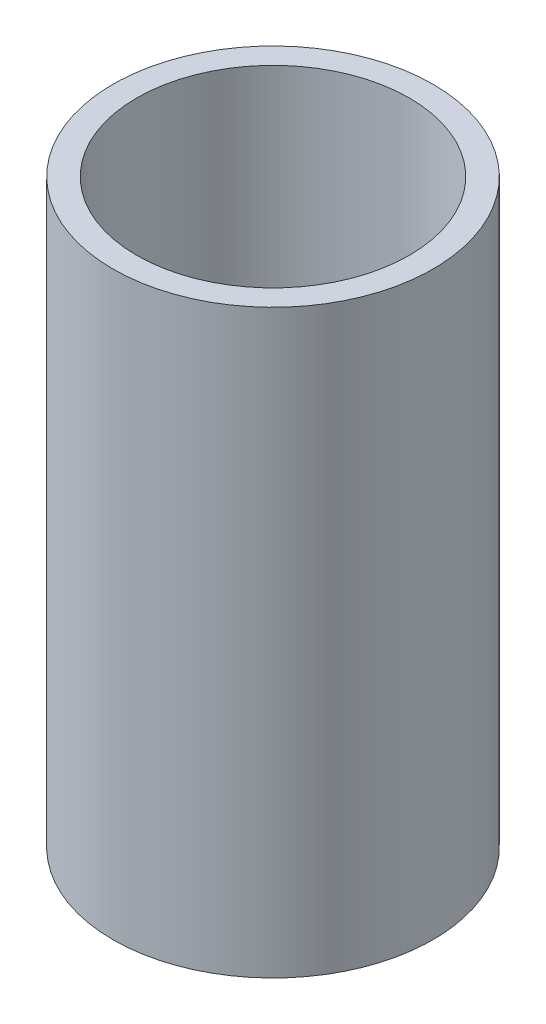
ISO-10303-21;
HEADER;
FILE_DESCRIPTION(('STEP AP214'),'2;1');
FILE_NAME('part.step','',(''),(''),'','','');
FILE_SCHEMA(('AUTOMOTIVE_DESIGN { 1 0 10303 214 1 1 1 1 }'));
ENDSEC;
DATA;
#1=APPLICATION_CONTEXT('core data for automotive mechanical design processes');
#2=APPLICATION_PROTOCOL_DEFINITION('international standard','automotive_design',2000,#1);
#3=PRODUCT_CONTEXT('',#1,'mechanical');
#4=PRODUCT('Part','Part','',(#3));
#5=PRODUCT_RELATED_PRODUCT_CATEGORY('part','',(#4));
#6=PRODUCT_DEFINITION_FORMATION('','',#4);
#7=PRODUCT_DEFINITION_CONTEXT('part definition',#1,'design');
#8=PRODUCT_DEFINITION('design','',#6,#7);
#9=PRODUCT_DEFINITION_SHAPE('','',#8);
#10=(LENGTH_UNIT() NAMED_UNIT(*) SI_UNIT(.MILLI.,.METRE.));
#11=(NAMED_UNIT(*) PLANE_ANGLE_UNIT() SI_UNIT($,.RADIAN.));
#12=(NAMED_UNIT(*) SI_UNIT($,.STERADIAN.) SOLID_ANGLE_UNIT());
#13=UNCERTAINTY_MEASURE_WITH_UNIT(LENGTH_MEASURE(1.E-05),#10,'distance_accuracy_value','');
#14=(GEOMETRIC_REPRESENTATION_CONTEXT(3) GLOBAL_UNCERTAINTY_ASSIGNED_CONTEXT((#13)) GLOBAL_UNIT_ASSIGNED_CONTEXT((#10,
#11,#12)) REPRESENTATION_CONTEXT('',''));
#15=CARTESIAN_POINT('',(0.,0.,0.));
#16=DIRECTION('',(0.,0.,1.));
#17=DIRECTION('',(1.,0.,0.));
#18=AXIS2_PLACEMENT_3D('',#15,#16,#17);
#19=CARTESIAN_POINT('',(0.,49.,0.));
#20=DIRECTION('',(0.,1.,0.));
#21=DIRECTION('',(0.,0.,1.));
#22=AXIS2_PLACEMENT_3D('',#19,#20,#21);
#23=PLANE('',#22);
#24=CARTESIAN_POINT('',(0.,49.,0.));
#25=DIRECTION('',(0.,1.,0.));
#26=DIRECTION('',(0.,0.,1.));
#27=AXIS2_PLACEMENT_3D('',#24,#25,#26);
#28=CIRCLE('',#27,13.5);
#29=CARTESIAN_POINT('',(0.,49.,13.5));
#30=VERTEX_POINT('',#29);
#31=EDGE_CURVE('E10',#30,#30,#28,.T.);
#32=ORIENTED_EDGE('',*,*,#31,.T.);
#33=EDGE_LOOP('',(#32));
#34=FACE_BOUND('',#33,.T.);
#35=CARTESIAN_POINT('',(0.,49.,0.));
#36=DIRECTION('',(0.,1.,0.));
#37=DIRECTION('',(0.,0.,1.));
#38=AXIS2_PLACEMENT_3D('',#35,#36,#37);
#39=CIRCLE('',#38,11.5);
#40=CARTESIAN_POINT('',(0.,49.,11.5));
#41=VERTEX_POINT('',#40);
#42=EDGE_CURVE('E50',#41,#41,#39,.T.);
#43=ORIENTED_EDGE('',*,*,#42,.F.);
#44=EDGE_LOOP('',(#43));
#45=FACE_BOUND('',#44,.T.);
#46=ADVANCED_FACE('F37',(#34,#45),#23,.T.);
#47=CARTESIAN_POINT('',(0.,0.,0.));
#48=DIRECTION('',(0.,1.,0.));
#49=DIRECTION('',(0.,0.,1.));
#50=AXIS2_PLACEMENT_3D('',#47,#48,#49);
#51=PLANE('',#50);
#52=CARTESIAN_POINT('',(0.,0.,0.));
#53=DIRECTION('',(0.,1.,0.));
#54=DIRECTION('',(0.,0.,1.));
#55=AXIS2_PLACEMENT_3D('',#52,#53,#54);
#56=CIRCLE('',#55,13.5);
#57=CARTESIAN_POINT('',(0.,0.,13.5));
#58=VERTEX_POINT('',#57);
#59=EDGE_CURVE('E41',#58,#58,#56,.T.);
#60=ORIENTED_EDGE('',*,*,#59,.F.);
#61=EDGE_LOOP('',(#60));
#62=FACE_BOUND('',#61,.T.);
#63=CARTESIAN_POINT('',(0.,0.,0.));
#64=DIRECTION('',(0.,1.,0.));
#65=DIRECTION('',(0.,0.,1.));
#66=AXIS2_PLACEMENT_3D('',#63,#64,#65);
#67=CIRCLE('',#66,11.5);
#68=CARTESIAN_POINT('',(0.,0.,11.5));
#69=VERTEX_POINT('',#68);
#70=EDGE_CURVE('E52',#69,#69,#67,.T.);
#71=ORIENTED_EDGE('',*,*,#70,.T.);
#72=EDGE_LOOP('',(#71));
#73=FACE_BOUND('',#72,.T.);
#74=ADVANCED_FACE('F64',(#62,#73),#51,.F.);
#75=CARTESIAN_POINT('',(0.,49.,0.));
#76=DIRECTION('',(0.,-1.,0.));
#77=DIRECTION('',(0.,0.,-1.));
#78=AXIS2_PLACEMENT_3D('',#75,#76,#77);
#79=CYLINDRICAL_SURFACE('',#78,13.5);
#80=ORIENTED_EDGE('',*,*,#31,.F.);
#81=EDGE_LOOP('',(#80));
#82=FACE_BOUND('',#81,.T.);
#83=ORIENTED_EDGE('',*,*,#59,.T.);
#84=EDGE_LOOP('',(#83));
#85=FACE_BOUND('',#84,.T.);
#86=ADVANCED_FACE('F39',(#82,#85),#79,.T.);
#87=CARTESIAN_POINT('',(0.,49.,0.));
#88=DIRECTION('',(0.,-1.,0.));
#89=DIRECTION('',(0.,0.,-1.));
#90=AXIS2_PLACEMENT_3D('',#87,#88,#89);
#91=CYLINDRICAL_SURFACE('',#90,11.5);
#92=ORIENTED_EDGE('',*,*,#42,.T.);
#93=EDGE_LOOP('',(#92));
#94=FACE_BOUND('',#93,.T.);
#95=ORIENTED_EDGE('',*,*,#70,.F.);
#96=EDGE_LOOP('',(#95));
#97=FACE_BOUND('',#96,.T.);
#98=ADVANCED_FACE('F60',(#94,#97),#91,.F.);
#99=CLOSED_SHELL('',(#46,#74,#86,#98));
#100=MANIFOLD_SOLID_BREP('B2',#99);
#101=ADVANCED_BREP_SHAPE_REPRESENTATION('',(#18,#100),#14);
#102=SHAPE_DEFINITION_REPRESENTATION(#9,#101);
ENDSEC;
END-ISO-10303-21;
